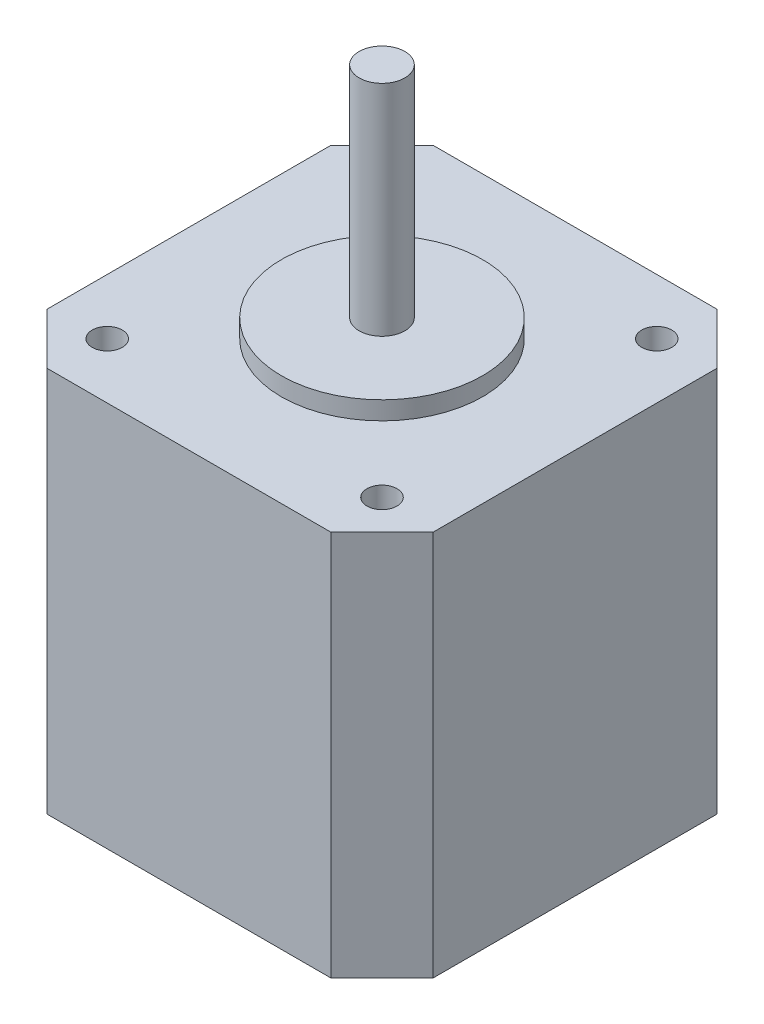
ISO-10303-21;
HEADER;
FILE_DESCRIPTION(('STEP AP214'),'2;1');
FILE_NAME('part.step','',(''),(''),'','','');
FILE_SCHEMA(('AUTOMOTIVE_DESIGN { 1 0 10303 214 1 1 1 1 }'));
ENDSEC;
DATA;
#1=APPLICATION_CONTEXT('core data for automotive mechanical design processes');
#2=APPLICATION_PROTOCOL_DEFINITION('international standard','automotive_design',2000,#1);
#3=PRODUCT_CONTEXT('',#1,'mechanical');
#4=PRODUCT('Part','Part','',(#3));
#5=PRODUCT_RELATED_PRODUCT_CATEGORY('part','',(#4));
#6=PRODUCT_DEFINITION_FORMATION('','',#4);
#7=PRODUCT_DEFINITION_CONTEXT('part definition',#1,'design');
#8=PRODUCT_DEFINITION('design','',#6,#7);
#9=PRODUCT_DEFINITION_SHAPE('','',#8);
#10=(LENGTH_UNIT() NAMED_UNIT(*) SI_UNIT(.MILLI.,.METRE.));
#11=(NAMED_UNIT(*) PLANE_ANGLE_UNIT() SI_UNIT($,.RADIAN.));
#12=(NAMED_UNIT(*) SI_UNIT($,.STERADIAN.) SOLID_ANGLE_UNIT());
#13=UNCERTAINTY_MEASURE_WITH_UNIT(LENGTH_MEASURE(1.E-05),#10,'distance_accuracy_value','');
#14=(GEOMETRIC_REPRESENTATION_CONTEXT(3) GLOBAL_UNCERTAINTY_ASSIGNED_CONTEXT((#13)) GLOBAL_UNIT_ASSIGNED_CONTEXT((#10,
#11,#12)) REPRESENTATION_CONTEXT('',''));
#15=CARTESIAN_POINT('',(0.,0.,0.));
#16=DIRECTION('',(0.,0.,1.));
#17=DIRECTION('',(1.,0.,0.));
#18=AXIS2_PLACEMENT_3D('',#15,#16,#17);
#19=CARTESIAN_POINT('',(21.15,21.15,-21.15));
#20=DIRECTION('',(-1.,0.,0.));
#21=DIRECTION('',(0.,0.,1.));
#22=AXIS2_PLACEMENT_3D('',#19,#20,#21);
#23=PLANE('',#22);
#24=DIRECTION('',(0.,0.,-1.));
#25=VECTOR('',#24,1.);
#26=CARTESIAN_POINT('',(21.15,-21.15,-21.15));
#27=LINE('',#26,#25);
#28=CARTESIAN_POINT('',(21.15,-21.15,15.55));
#29=VERTEX_POINT('',#28);
#30=CARTESIAN_POINT('',(21.15,-21.15,-15.55));
#31=VERTEX_POINT('',#30);
#32=EDGE_CURVE('E133',#29,#31,#27,.T.);
#33=ORIENTED_EDGE('',*,*,#32,.T.);
#34=DIRECTION('',(0.,1.,0.));
#35=VECTOR('',#34,1.);
#36=CARTESIAN_POINT('',(21.15,21.15,-15.55));
#37=LINE('',#36,#35);
#38=CARTESIAN_POINT('',(21.15,21.15,-15.55));
#39=VERTEX_POINT('',#38);
#40=EDGE_CURVE('E155',#31,#39,#37,.T.);
#41=ORIENTED_EDGE('',*,*,#40,.T.);
#42=DIRECTION('',(0.,0.,-1.));
#43=VECTOR('',#42,1.);
#44=CARTESIAN_POINT('',(21.15,21.15,-21.15));
#45=LINE('',#44,#43);
#46=CARTESIAN_POINT('',(21.15,21.15,15.55));
#47=VERTEX_POINT('',#46);
#48=EDGE_CURVE('E131',#47,#39,#45,.T.);
#49=ORIENTED_EDGE('',*,*,#48,.F.);
#50=DIRECTION('',(0.,-1.,0.));
#51=VECTOR('',#50,1.);
#52=CARTESIAN_POINT('',(21.15,21.15,15.55));
#53=LINE('',#52,#51);
#54=EDGE_CURVE('E152',#47,#29,#53,.T.);
#55=ORIENTED_EDGE('',*,*,#54,.T.);
#56=EDGE_LOOP('',(#33,#41,#49,#55));
#57=FACE_BOUND('',#56,.T.);
#58=ADVANCED_FACE('F36',(#57),#23,.F.);
#59=CARTESIAN_POINT('',(-21.15,21.15,-21.15));
#60=DIRECTION('',(0.,0.,1.));
#61=DIRECTION('',(1.,0.,0.));
#62=AXIS2_PLACEMENT_3D('',#59,#60,#61);
#63=PLANE('',#62);
#64=DIRECTION('',(-1.,0.,0.));
#65=VECTOR('',#64,1.);
#66=CARTESIAN_POINT('',(-21.15,-21.15,-21.15));
#67=LINE('',#66,#65);
#68=CARTESIAN_POINT('',(15.55,-21.15,-21.15));
#69=VERTEX_POINT('',#68);
#70=CARTESIAN_POINT('',(-15.55,-21.15,-21.15));
#71=VERTEX_POINT('',#70);
#72=EDGE_CURVE('E129',#69,#71,#67,.T.);
#73=ORIENTED_EDGE('',*,*,#72,.T.);
#74=DIRECTION('',(0.,1.,0.));
#75=VECTOR('',#74,1.);
#76=CARTESIAN_POINT('',(-15.55,21.15,-21.15));
#77=LINE('',#76,#75);
#78=CARTESIAN_POINT('',(-15.55,21.15,-21.15));
#79=VERTEX_POINT('',#78);
#80=EDGE_CURVE('E107',#71,#79,#77,.T.);
#81=ORIENTED_EDGE('',*,*,#80,.T.);
#82=DIRECTION('',(-1.,0.,0.));
#83=VECTOR('',#82,1.);
#84=CARTESIAN_POINT('',(-21.15,21.15,-21.15));
#85=LINE('',#84,#83);
#86=CARTESIAN_POINT('',(15.55,21.15,-21.15));
#87=VERTEX_POINT('',#86);
#88=EDGE_CURVE('E169',#87,#79,#85,.T.);
#89=ORIENTED_EDGE('',*,*,#88,.F.);
#90=DIRECTION('',(0.,-1.,0.));
#91=VECTOR('',#90,1.);
#92=CARTESIAN_POINT('',(15.55,21.15,-21.15));
#93=LINE('',#92,#91);
#94=EDGE_CURVE('E112',#87,#69,#93,.T.);
#95=ORIENTED_EDGE('',*,*,#94,.T.);
#96=EDGE_LOOP('',(#73,#81,#89,#95));
#97=FACE_BOUND('',#96,.T.);
#98=ADVANCED_FACE('F174',(#97),#63,.F.);
#99=CARTESIAN_POINT('',(-21.15,21.15,-21.15));
#100=DIRECTION('',(1.,0.,0.));
#101=DIRECTION('',(0.,0.,-1.));
#102=AXIS2_PLACEMENT_3D('',#99,#100,#101);
#103=PLANE('',#102);
#104=DIRECTION('',(0.,0.,1.));
#105=VECTOR('',#104,1.);
#106=CARTESIAN_POINT('',(-21.15,21.15,-21.15));
#107=LINE('',#106,#105);
#108=CARTESIAN_POINT('',(-21.15,21.15,-15.55));
#109=VERTEX_POINT('',#108);
#110=CARTESIAN_POINT('',(-21.15,21.15,15.55));
#111=VERTEX_POINT('',#110);
#112=EDGE_CURVE('E121',#109,#111,#107,.T.);
#113=ORIENTED_EDGE('',*,*,#112,.F.);
#114=DIRECTION('',(0.,-1.,0.));
#115=VECTOR('',#114,1.);
#116=CARTESIAN_POINT('',(-21.15,21.15,-15.55));
#117=LINE('',#116,#115);
#118=CARTESIAN_POINT('',(-21.15,-21.15,-15.55));
#119=VERTEX_POINT('',#118);
#120=EDGE_CURVE('E106',#109,#119,#117,.T.);
#121=ORIENTED_EDGE('',*,*,#120,.T.);
#122=DIRECTION('',(0.,0.,1.));
#123=VECTOR('',#122,1.);
#124=CARTESIAN_POINT('',(-21.15,-21.15,-21.15));
#125=LINE('',#124,#123);
#126=CARTESIAN_POINT('',(-21.15,-21.15,15.55));
#127=VERTEX_POINT('',#126);
#128=EDGE_CURVE('E119',#119,#127,#125,.T.);
#129=ORIENTED_EDGE('',*,*,#128,.T.);
#130=DIRECTION('',(0.,1.,0.));
#131=VECTOR('',#130,1.);
#132=CARTESIAN_POINT('',(-21.15,21.15,15.55));
#133=LINE('',#132,#131);
#134=EDGE_CURVE('E123',#127,#111,#133,.T.);
#135=ORIENTED_EDGE('',*,*,#134,.T.);
#136=EDGE_LOOP('',(#113,#121,#129,#135));
#137=FACE_BOUND('',#136,.T.);
#138=ADVANCED_FACE('F118',(#137),#103,.F.);
#139=CARTESIAN_POINT('',(-21.15,21.15,21.15));
#140=DIRECTION('',(0.,0.,-1.));
#141=DIRECTION('',(-1.,0.,0.));
#142=AXIS2_PLACEMENT_3D('',#139,#140,#141);
#143=PLANE('',#142);
#144=DIRECTION('',(1.,0.,0.));
#145=VECTOR('',#144,1.);
#146=CARTESIAN_POINT('',(-21.15,21.15,21.15));
#147=LINE('',#146,#145);
#148=CARTESIAN_POINT('',(-15.55,21.15,21.15));
#149=VERTEX_POINT('',#148);
#150=CARTESIAN_POINT('',(15.55,21.15,21.15));
#151=VERTEX_POINT('',#150);
#152=EDGE_CURVE('E180',#149,#151,#147,.T.);
#153=ORIENTED_EDGE('',*,*,#152,.F.);
#154=DIRECTION('',(0.,-1.,0.));
#155=VECTOR('',#154,1.);
#156=CARTESIAN_POINT('',(-15.55,21.15,21.15));
#157=LINE('',#156,#155);
#158=CARTESIAN_POINT('',(-15.55,-21.15,21.15));
#159=VERTEX_POINT('',#158);
#160=EDGE_CURVE('E11',#149,#159,#157,.T.);
#161=ORIENTED_EDGE('',*,*,#160,.T.);
#162=DIRECTION('',(1.,0.,0.));
#163=VECTOR('',#162,1.);
#164=CARTESIAN_POINT('',(-21.15,-21.15,21.15));
#165=LINE('',#164,#163);
#166=CARTESIAN_POINT('',(15.55,-21.15,21.15));
#167=VERTEX_POINT('',#166);
#168=EDGE_CURVE('E128',#159,#167,#165,.T.);
#169=ORIENTED_EDGE('',*,*,#168,.T.);
#170=DIRECTION('',(0.,1.,0.));
#171=VECTOR('',#170,1.);
#172=CARTESIAN_POINT('',(15.55,21.15,21.15));
#173=LINE('',#172,#171);
#174=EDGE_CURVE('E44',#167,#151,#173,.T.);
#175=ORIENTED_EDGE('',*,*,#174,.T.);
#176=EDGE_LOOP('',(#153,#161,#169,#175));
#177=FACE_BOUND('',#176,.T.);
#178=ADVANCED_FACE('F227',(#177),#143,.F.);
#179=CARTESIAN_POINT('',(0.,21.15,0.));
#180=DIRECTION('',(0.,1.,0.));
#181=DIRECTION('',(0.,0.,1.));
#182=AXIS2_PLACEMENT_3D('',#179,#180,#181);
#183=PLANE('',#182);
#184=CARTESIAN_POINT('',(-15.05,21.15,15.05));
#185=DIRECTION('',(0.,1.,0.));
#186=DIRECTION('',(0.,0.,1.));
#187=AXIS2_PLACEMENT_3D('',#184,#185,#186);
#188=CIRCLE('',#187,1.65);
#189=CARTESIAN_POINT('',(-15.05,21.15,16.7));
#190=VERTEX_POINT('',#189);
#191=EDGE_CURVE('E198',#190,#190,#188,.T.);
#192=ORIENTED_EDGE('',*,*,#191,.F.);
#193=EDGE_LOOP('',(#192));
#194=FACE_BOUND('',#193,.T.);
#195=CARTESIAN_POINT('',(15.05,21.15,15.05));
#196=DIRECTION('',(0.,1.,0.));
#197=DIRECTION('',(0.,0.,1.));
#198=AXIS2_PLACEMENT_3D('',#195,#196,#197);
#199=CIRCLE('',#198,1.65);
#200=CARTESIAN_POINT('',(15.05,21.15,16.7));
#201=VERTEX_POINT('',#200);
#202=EDGE_CURVE('E204',#201,#201,#199,.T.);
#203=ORIENTED_EDGE('',*,*,#202,.F.);
#204=EDGE_LOOP('',(#203));
#205=FACE_BOUND('',#204,.T.);
#206=CARTESIAN_POINT('',(15.05,21.15,-15.05));
#207=DIRECTION('',(0.,1.,0.));
#208=DIRECTION('',(0.,0.,1.));
#209=AXIS2_PLACEMENT_3D('',#206,#207,#208);
#210=CIRCLE('',#209,1.65);
#211=CARTESIAN_POINT('',(15.05,21.15,-13.4));
#212=VERTEX_POINT('',#211);
#213=EDGE_CURVE('E210',#212,#212,#210,.T.);
#214=ORIENTED_EDGE('',*,*,#213,.F.);
#215=EDGE_LOOP('',(#214));
#216=FACE_BOUND('',#215,.T.);
#217=CARTESIAN_POINT('',(-15.05,21.15,-15.05));
#218=DIRECTION('',(0.,1.,0.));
#219=DIRECTION('',(0.,0.,1.));
#220=AXIS2_PLACEMENT_3D('',#217,#218,#219);
#221=CIRCLE('',#220,1.65);
#222=CARTESIAN_POINT('',(-15.05,21.15,-13.4));
#223=VERTEX_POINT('',#222);
#224=EDGE_CURVE('E192',#223,#223,#221,.T.);
#225=ORIENTED_EDGE('',*,*,#224,.F.);
#226=EDGE_LOOP('',(#225));
#227=FACE_BOUND('',#226,.T.);
#228=CARTESIAN_POINT('',(0.,21.15,0.));
#229=DIRECTION('',(0.,1.,0.));
#230=DIRECTION('',(0.,0.,1.));
#231=AXIS2_PLACEMENT_3D('',#228,#229,#230);
#232=CIRCLE('',#231,11.025);
#233=CARTESIAN_POINT('',(0.,21.15,11.025));
#234=VERTEX_POINT('',#233);
#235=EDGE_CURVE('E182',#234,#234,#232,.T.);
#236=ORIENTED_EDGE('',*,*,#235,.F.);
#237=EDGE_LOOP('',(#236));
#238=FACE_BOUND('',#237,.T.);
#239=ORIENTED_EDGE('',*,*,#88,.T.);
#240=DIRECTION('',(0.707106781186548,0.,-0.707106781186547));
#241=VECTOR('',#240,1.);
#242=CARTESIAN_POINT('',(-18.35,21.15,-18.35));
#243=LINE('',#242,#241);
#244=EDGE_CURVE('E150',#79,#109,#243,.F.);
#245=ORIENTED_EDGE('',*,*,#244,.T.);
#246=ORIENTED_EDGE('',*,*,#112,.T.);
#247=DIRECTION('',(-0.707106781186545,0.,-0.70710678118655));
#248=VECTOR('',#247,1.);
#249=CARTESIAN_POINT('',(-18.3500000000001,21.15,18.35));
#250=LINE('',#249,#248);
#251=EDGE_CURVE('E57',#111,#149,#250,.F.);
#252=ORIENTED_EDGE('',*,*,#251,.T.);
#253=ORIENTED_EDGE('',*,*,#152,.T.);
#254=DIRECTION('',(-0.70710678118655,0.,0.707106781186545));
#255=VECTOR('',#254,1.);
#256=CARTESIAN_POINT('',(18.3499999999999,21.15,18.3500000000001));
#257=LINE('',#256,#255);
#258=EDGE_CURVE('E145',#151,#47,#257,.F.);
#259=ORIENTED_EDGE('',*,*,#258,.T.);
#260=ORIENTED_EDGE('',*,*,#48,.T.);
#261=DIRECTION('',(0.707106781186546,0.,0.707106781186549));
#262=VECTOR('',#261,1.);
#263=CARTESIAN_POINT('',(18.35,21.15,-18.3499999999999));
#264=LINE('',#263,#262);
#265=EDGE_CURVE('E148',#39,#87,#264,.F.);
#266=ORIENTED_EDGE('',*,*,#265,.T.);
#267=EDGE_LOOP('',(#239,#245,#246,#252,#253,#259,#260,#266));
#268=FACE_BOUND('',#267,.T.);
#269=ADVANCED_FACE('F166',(#194,#205,#216,#227,#238,#268),#183,.T.);
#270=CARTESIAN_POINT('',(0.,-21.15,0.));
#271=DIRECTION('',(0.,1.,0.));
#272=DIRECTION('',(0.,0.,1.));
#273=AXIS2_PLACEMENT_3D('',#270,#271,#272);
#274=PLANE('',#273);
#275=ORIENTED_EDGE('',*,*,#128,.F.);
#276=DIRECTION('',(-0.707106781186548,0.,0.707106781186547));
#277=VECTOR('',#276,1.);
#278=CARTESIAN_POINT('',(-21.15,-21.15,-15.55));
#279=LINE('',#278,#277);
#280=EDGE_CURVE('E102',#119,#71,#279,.F.);
#281=ORIENTED_EDGE('',*,*,#280,.T.);
#282=ORIENTED_EDGE('',*,*,#72,.F.);
#283=DIRECTION('',(-0.707106781186546,0.,-0.707106781186549));
#284=VECTOR('',#283,1.);
#285=CARTESIAN_POINT('',(15.55,-21.15,-21.15));
#286=LINE('',#285,#284);
#287=EDGE_CURVE('E113',#69,#31,#286,.F.);
#288=ORIENTED_EDGE('',*,*,#287,.T.);
#289=ORIENTED_EDGE('',*,*,#32,.F.);
#290=DIRECTION('',(0.70710678118655,0.,-0.707106781186545));
#291=VECTOR('',#290,1.);
#292=CARTESIAN_POINT('',(21.15,-21.15,15.55));
#293=LINE('',#292,#291);
#294=EDGE_CURVE('E122',#29,#167,#293,.F.);
#295=ORIENTED_EDGE('',*,*,#294,.T.);
#296=ORIENTED_EDGE('',*,*,#168,.F.);
#297=DIRECTION('',(0.707106781186545,0.,0.70710678118655));
#298=VECTOR('',#297,1.);
#299=CARTESIAN_POINT('',(-15.55,-21.15,21.15));
#300=LINE('',#299,#298);
#301=EDGE_CURVE('E127',#159,#127,#300,.F.);
#302=ORIENTED_EDGE('',*,*,#301,.T.);
#303=EDGE_LOOP('',(#275,#281,#282,#288,#289,#295,#296,#302));
#304=FACE_BOUND('',#303,.T.);
#305=ADVANCED_FACE('F125',(#304),#274,.F.);
#306=CARTESIAN_POINT('',(0.,23.15,0.));
#307=DIRECTION('',(0.,-1.,0.));
#308=DIRECTION('',(0.,0.,-1.));
#309=AXIS2_PLACEMENT_3D('',#306,#307,#308);
#310=CYLINDRICAL_SURFACE('',#309,11.025);
#311=CARTESIAN_POINT('',(0.,23.15,0.));
#312=DIRECTION('',(0.,1.,0.));
#313=DIRECTION('',(0.,0.,1.));
#314=AXIS2_PLACEMENT_3D('',#311,#312,#313);
#315=CIRCLE('',#314,11.025);
#316=CARTESIAN_POINT('',(0.,23.15,11.025));
#317=VERTEX_POINT('',#316);
#318=EDGE_CURVE('E175',#317,#317,#315,.T.);
#319=ORIENTED_EDGE('',*,*,#318,.F.);
#320=EDGE_LOOP('',(#319));
#321=FACE_BOUND('',#320,.T.);
#322=ORIENTED_EDGE('',*,*,#235,.T.);
#323=EDGE_LOOP('',(#322));
#324=FACE_BOUND('',#323,.T.);
#325=ADVANCED_FACE('F234',(#321,#324),#310,.T.);
#326=CARTESIAN_POINT('',(0.,23.15,0.));
#327=DIRECTION('',(0.,1.,0.));
#328=DIRECTION('',(0.,0.,1.));
#329=AXIS2_PLACEMENT_3D('',#326,#327,#328);
#330=PLANE('',#329);
#331=CARTESIAN_POINT('',(0.,23.15,0.));
#332=DIRECTION('',(0.,1.,0.));
#333=DIRECTION('',(0.,0.,1.));
#334=AXIS2_PLACEMENT_3D('',#331,#332,#333);
#335=CIRCLE('',#334,2.506);
#336=CARTESIAN_POINT('',(0.,23.15,2.506));
#337=VERTEX_POINT('',#336);
#338=EDGE_CURVE('E137',#337,#337,#335,.T.);
#339=ORIENTED_EDGE('',*,*,#338,.F.);
#340=EDGE_LOOP('',(#339));
#341=FACE_BOUND('',#340,.T.);
#342=ORIENTED_EDGE('',*,*,#318,.T.);
#343=EDGE_LOOP('',(#342));
#344=FACE_BOUND('',#343,.T.);
#345=ADVANCED_FACE('F236',(#341,#344),#330,.T.);
#346=CARTESIAN_POINT('',(0.,47.15,0.));
#347=DIRECTION('',(0.,-1.,0.));
#348=DIRECTION('',(0.,0.,-1.));
#349=AXIS2_PLACEMENT_3D('',#346,#347,#348);
#350=CYLINDRICAL_SURFACE('',#349,2.506);
#351=CARTESIAN_POINT('',(0.,47.15,0.));
#352=DIRECTION('',(0.,1.,0.));
#353=DIRECTION('',(0.,0.,1.));
#354=AXIS2_PLACEMENT_3D('',#351,#352,#353);
#355=CIRCLE('',#354,2.506);
#356=CARTESIAN_POINT('',(0.,47.15,2.506));
#357=VERTEX_POINT('',#356);
#358=EDGE_CURVE('E177',#357,#357,#355,.T.);
#359=ORIENTED_EDGE('',*,*,#358,.F.);
#360=EDGE_LOOP('',(#359));
#361=FACE_BOUND('',#360,.T.);
#362=ORIENTED_EDGE('',*,*,#338,.T.);
#363=EDGE_LOOP('',(#362));
#364=FACE_BOUND('',#363,.T.);
#365=ADVANCED_FACE('F243',(#361,#364),#350,.T.);
#366=CARTESIAN_POINT('',(0.,47.15,0.));
#367=DIRECTION('',(0.,1.,0.));
#368=DIRECTION('',(0.,0.,1.));
#369=AXIS2_PLACEMENT_3D('',#366,#367,#368);
#370=PLANE('',#369);
#371=ORIENTED_EDGE('',*,*,#358,.T.);
#372=EDGE_LOOP('',(#371));
#373=FACE_BOUND('',#372,.T.);
#374=ADVANCED_FACE('F259',(#373),#370,.T.);
#375=CARTESIAN_POINT('',(-21.15,21.15,-15.55));
#376=DIRECTION('',(0.707106781186547,0.,0.707106781186548));
#377=DIRECTION('',(0.,-1.,0.));
#378=AXIS2_PLACEMENT_3D('',#375,#376,#377);
#379=PLANE('',#378);
#380=ORIENTED_EDGE('',*,*,#244,.F.);
#381=ORIENTED_EDGE('',*,*,#80,.F.);
#382=ORIENTED_EDGE('',*,*,#280,.F.);
#383=ORIENTED_EDGE('',*,*,#120,.F.);
#384=EDGE_LOOP('',(#380,#381,#382,#383));
#385=FACE_BOUND('',#384,.T.);
#386=ADVANCED_FACE('F105',(#385),#379,.F.);
#387=CARTESIAN_POINT('',(15.55,21.15,-21.15));
#388=DIRECTION('',(-0.707106781186549,0.,0.707106781186546));
#389=DIRECTION('',(0.,-1.,0.));
#390=AXIS2_PLACEMENT_3D('',#387,#388,#389);
#391=PLANE('',#390);
#392=ORIENTED_EDGE('',*,*,#265,.F.);
#393=ORIENTED_EDGE('',*,*,#40,.F.);
#394=ORIENTED_EDGE('',*,*,#287,.F.);
#395=ORIENTED_EDGE('',*,*,#94,.F.);
#396=EDGE_LOOP('',(#392,#393,#394,#395));
#397=FACE_BOUND('',#396,.T.);
#398=ADVANCED_FACE('F172',(#397),#391,.F.);
#399=CARTESIAN_POINT('',(-15.55,21.15,21.15));
#400=DIRECTION('',(0.70710678118655,0.,-0.707106781186545));
#401=DIRECTION('',(0.,-1.,0.));
#402=AXIS2_PLACEMENT_3D('',#399,#400,#401);
#403=PLANE('',#402);
#404=ORIENTED_EDGE('',*,*,#251,.F.);
#405=ORIENTED_EDGE('',*,*,#134,.F.);
#406=ORIENTED_EDGE('',*,*,#301,.F.);
#407=ORIENTED_EDGE('',*,*,#160,.F.);
#408=EDGE_LOOP('',(#404,#405,#406,#407));
#409=FACE_BOUND('',#408,.T.);
#410=ADVANCED_FACE('F261',(#409),#403,.F.);
#411=CARTESIAN_POINT('',(21.15,21.15,15.55));
#412=DIRECTION('',(-0.707106781186545,0.,-0.70710678118655));
#413=DIRECTION('',(0.,-1.,0.));
#414=AXIS2_PLACEMENT_3D('',#411,#412,#413);
#415=PLANE('',#414);
#416=ORIENTED_EDGE('',*,*,#258,.F.);
#417=ORIENTED_EDGE('',*,*,#174,.F.);
#418=ORIENTED_EDGE('',*,*,#294,.F.);
#419=ORIENTED_EDGE('',*,*,#54,.F.);
#420=EDGE_LOOP('',(#416,#417,#418,#419));
#421=FACE_BOUND('',#420,.T.);
#422=ADVANCED_FACE('F38',(#421),#415,.F.);
#423=CARTESIAN_POINT('',(-15.05,11.15,-15.05));
#424=DIRECTION('',(0.,1.,0.));
#425=DIRECTION('',(0.,0.,1.));
#426=AXIS2_PLACEMENT_3D('',#423,#424,#425);
#427=CYLINDRICAL_SURFACE('',#426,1.65);
#428=CARTESIAN_POINT('',(-15.05,11.15,-15.05));
#429=DIRECTION('',(0.,1.,0.));
#430=DIRECTION('',(0.,0.,1.));
#431=AXIS2_PLACEMENT_3D('',#428,#429,#430);
#432=CIRCLE('',#431,1.65);
#433=CARTESIAN_POINT('',(-15.05,11.15,-13.4));
#434=VERTEX_POINT('',#433);
#435=EDGE_CURVE('E191',#434,#434,#432,.T.);
#436=ORIENTED_EDGE('',*,*,#435,.F.);
#437=EDGE_LOOP('',(#436));
#438=FACE_BOUND('',#437,.T.);
#439=ORIENTED_EDGE('',*,*,#224,.T.);
#440=EDGE_LOOP('',(#439));
#441=FACE_BOUND('',#440,.T.);
#442=ADVANCED_FACE('F267',(#438,#441),#427,.F.);
#443=CARTESIAN_POINT('',(-15.05,11.15,-15.05));
#444=DIRECTION('',(0.,1.,0.));
#445=DIRECTION('',(0.,0.,1.));
#446=AXIS2_PLACEMENT_3D('',#443,#444,#445);
#447=PLANE('',#446);
#448=ORIENTED_EDGE('',*,*,#435,.T.);
#449=EDGE_LOOP('',(#448));
#450=FACE_BOUND('',#449,.T.);
#451=ADVANCED_FACE('F221',(#450),#447,.T.);
#452=CARTESIAN_POINT('',(15.05,11.15,-15.05));
#453=DIRECTION('',(0.,1.,0.));
#454=DIRECTION('',(0.,0.,1.));
#455=AXIS2_PLACEMENT_3D('',#452,#453,#454);
#456=CYLINDRICAL_SURFACE('',#455,1.65);
#457=CARTESIAN_POINT('',(15.05,11.15,-15.05));
#458=DIRECTION('',(0.,1.,0.));
#459=DIRECTION('',(0.,0.,1.));
#460=AXIS2_PLACEMENT_3D('',#457,#458,#459);
#461=CIRCLE('',#460,1.65);
#462=CARTESIAN_POINT('',(15.05,11.15,-13.4));
#463=VERTEX_POINT('',#462);
#464=EDGE_CURVE('E195',#463,#463,#461,.T.);
#465=ORIENTED_EDGE('',*,*,#464,.F.);
#466=EDGE_LOOP('',(#465));
#467=FACE_BOUND('',#466,.T.);
#468=ORIENTED_EDGE('',*,*,#213,.T.);
#469=EDGE_LOOP('',(#468));
#470=FACE_BOUND('',#469,.T.);
#471=ADVANCED_FACE('F218',(#467,#470),#456,.F.);
#472=CARTESIAN_POINT('',(15.05,11.15,-15.05));
#473=DIRECTION('',(0.,1.,0.));
#474=DIRECTION('',(0.,0.,1.));
#475=AXIS2_PLACEMENT_3D('',#472,#473,#474);
#476=PLANE('',#475);
#477=ORIENTED_EDGE('',*,*,#464,.T.);
#478=EDGE_LOOP('',(#477));
#479=FACE_BOUND('',#478,.T.);
#480=ADVANCED_FACE('F216',(#479),#476,.T.);
#481=CARTESIAN_POINT('',(15.05,11.15,15.05));
#482=DIRECTION('',(0.,1.,0.));
#483=DIRECTION('',(0.,0.,1.));
#484=AXIS2_PLACEMENT_3D('',#481,#482,#483);
#485=CYLINDRICAL_SURFACE('',#484,1.65);
#486=CARTESIAN_POINT('',(15.05,11.15,15.05));
#487=DIRECTION('',(0.,1.,0.));
#488=DIRECTION('',(0.,0.,1.));
#489=AXIS2_PLACEMENT_3D('',#486,#487,#488);
#490=CIRCLE('',#489,1.65);
#491=CARTESIAN_POINT('',(15.05,11.15,16.7));
#492=VERTEX_POINT('',#491);
#493=EDGE_CURVE('E207',#492,#492,#490,.T.);
#494=ORIENTED_EDGE('',*,*,#493,.F.);
#495=EDGE_LOOP('',(#494));
#496=FACE_BOUND('',#495,.T.);
#497=ORIENTED_EDGE('',*,*,#202,.T.);
#498=EDGE_LOOP('',(#497));
#499=FACE_BOUND('',#498,.T.);
#500=ADVANCED_FACE('F379',(#496,#499),#485,.F.);
#501=CARTESIAN_POINT('',(15.05,11.15,15.05));
#502=DIRECTION('',(0.,1.,0.));
#503=DIRECTION('',(0.,0.,1.));
#504=AXIS2_PLACEMENT_3D('',#501,#502,#503);
#505=PLANE('',#504);
#506=ORIENTED_EDGE('',*,*,#493,.T.);
#507=EDGE_LOOP('',(#506));
#508=FACE_BOUND('',#507,.T.);
#509=ADVANCED_FACE('F388',(#508),#505,.T.);
#510=CARTESIAN_POINT('',(-15.05,11.15,15.05));
#511=DIRECTION('',(0.,1.,0.));
#512=DIRECTION('',(0.,0.,1.));
#513=AXIS2_PLACEMENT_3D('',#510,#511,#512);
#514=CYLINDRICAL_SURFACE('',#513,1.65);
#515=CARTESIAN_POINT('',(-15.05,11.15,15.05));
#516=DIRECTION('',(0.,1.,0.));
#517=DIRECTION('',(0.,0.,1.));
#518=AXIS2_PLACEMENT_3D('',#515,#516,#517);
#519=CIRCLE('',#518,1.65);
#520=CARTESIAN_POINT('',(-15.05,11.15,16.7));
#521=VERTEX_POINT('',#520);
#522=EDGE_CURVE('E201',#521,#521,#519,.T.);
#523=ORIENTED_EDGE('',*,*,#522,.F.);
#524=EDGE_LOOP('',(#523));
#525=FACE_BOUND('',#524,.T.);
#526=ORIENTED_EDGE('',*,*,#191,.T.);
#527=EDGE_LOOP('',(#526));
#528=FACE_BOUND('',#527,.T.);
#529=ADVANCED_FACE('F398',(#525,#528),#514,.F.);
#530=CARTESIAN_POINT('',(-15.05,11.15,15.05));
#531=DIRECTION('',(0.,1.,0.));
#532=DIRECTION('',(0.,0.,1.));
#533=AXIS2_PLACEMENT_3D('',#530,#531,#532);
#534=PLANE('',#533);
#535=ORIENTED_EDGE('',*,*,#522,.T.);
#536=EDGE_LOOP('',(#535));
#537=FACE_BOUND('',#536,.T.);
#538=ADVANCED_FACE('F408',(#537),#534,.T.);
#539=CLOSED_SHELL('',(#58,#98,#138,#178,#269,#305,#325,#345,#365,#374,#386,#398,#410,#422,#442,
#451,#471,#480,#500,#509,#529,#538));
#540=MANIFOLD_SOLID_BREP('B2',#539);
#541=ADVANCED_BREP_SHAPE_REPRESENTATION('',(#18,#540),#14);
#542=SHAPE_DEFINITION_REPRESENTATION(#9,#541);
ENDSEC;
END-ISO-10303-21;
